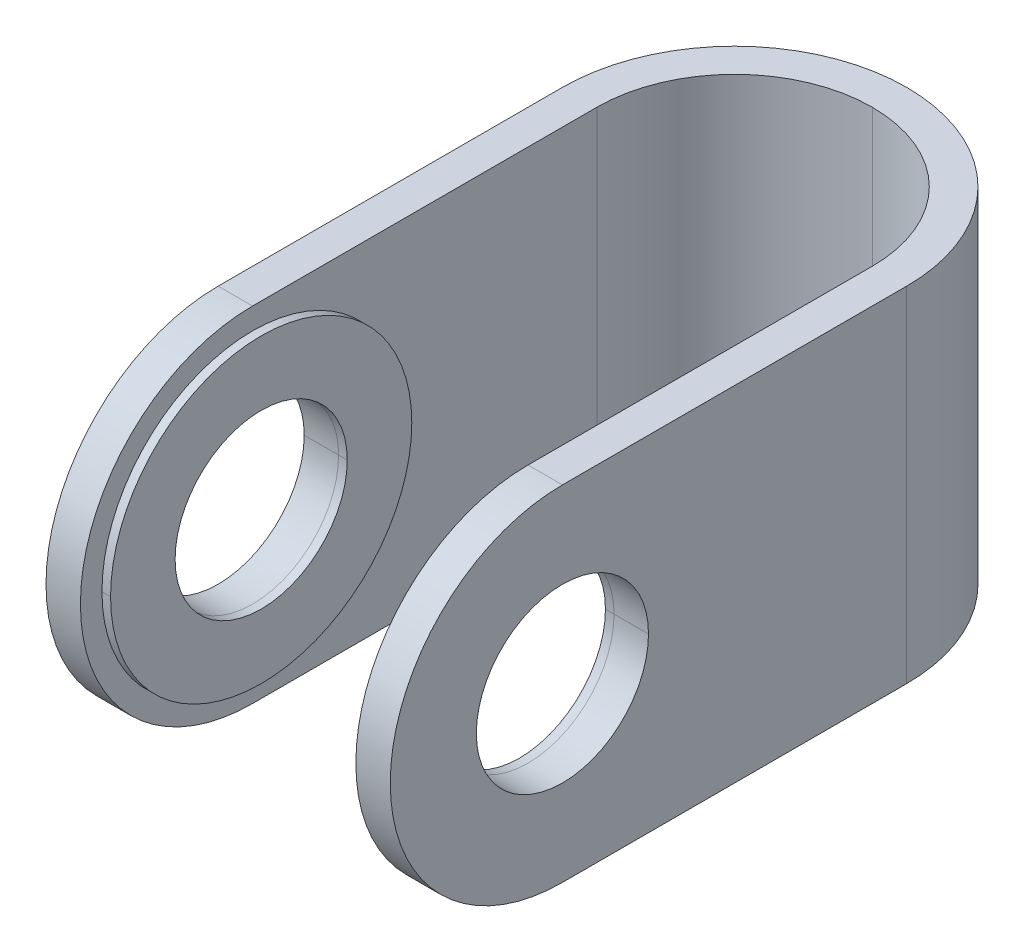
ISO-10303-21;
HEADER;
FILE_DESCRIPTION(('STEP AP214'),'2;1');
FILE_NAME('part.step','',(''),(''),'','','');
FILE_SCHEMA(('AUTOMOTIVE_DESIGN { 1 0 10303 214 1 1 1 1 }'));
ENDSEC;
DATA;
#1=APPLICATION_CONTEXT('core data for automotive mechanical design processes');
#2=APPLICATION_PROTOCOL_DEFINITION('international standard','automotive_design',2000,#1);
#3=PRODUCT_CONTEXT('',#1,'mechanical');
#4=PRODUCT('Part','Part','',(#3));
#5=PRODUCT_RELATED_PRODUCT_CATEGORY('part','',(#4));
#6=PRODUCT_DEFINITION_FORMATION('','',#4);
#7=PRODUCT_DEFINITION_CONTEXT('part definition',#1,'design');
#8=PRODUCT_DEFINITION('design','',#6,#7);
#9=PRODUCT_DEFINITION_SHAPE('','',#8);
#10=(LENGTH_UNIT() NAMED_UNIT(*) SI_UNIT(.MILLI.,.METRE.));
#11=(NAMED_UNIT(*) PLANE_ANGLE_UNIT() SI_UNIT($,.RADIAN.));
#12=(NAMED_UNIT(*) SI_UNIT($,.STERADIAN.) SOLID_ANGLE_UNIT());
#13=UNCERTAINTY_MEASURE_WITH_UNIT(LENGTH_MEASURE(1.E-05),#10,'distance_accuracy_value','');
#14=(GEOMETRIC_REPRESENTATION_CONTEXT(3) GLOBAL_UNCERTAINTY_ASSIGNED_CONTEXT((#13)) GLOBAL_UNIT_ASSIGNED_CONTEXT((#10,
#11,#12)) REPRESENTATION_CONTEXT('',''));
#15=CARTESIAN_POINT('',(0.,0.,0.));
#16=DIRECTION('',(0.,0.,1.));
#17=DIRECTION('',(1.,0.,0.));
#18=AXIS2_PLACEMENT_3D('',#15,#16,#17);
#19=CARTESIAN_POINT('',(17.287097909609,-8.869571953824,-0.784906063037));
#20=DIRECTION('',(1.,0.,0.));
#21=DIRECTION('',(0.,0.,-1.));
#22=AXIS2_PLACEMENT_3D('',#19,#20,#21);
#23=CYLINDRICAL_SURFACE('',#22,2.);
#24=DIRECTION('',(1.,0.,0.));
#25=VECTOR('',#24,1.);
#26=CARTESIAN_POINT('',(17.287097909609,-8.869571953824,1.215093936963));
#27=LINE('',#26,#25);
#28=CARTESIAN_POINT('',(17.287097909609,-8.869571953824,1.215093936963));
#29=VERTEX_POINT('',#28);
#30=CARTESIAN_POINT('',(17.487097909609,-8.869571953824,1.215093936963));
#31=VERTEX_POINT('',#30);
#32=EDGE_CURVE('P0_E98',#29,#31,#27,.T.);
#33=ORIENTED_EDGE('',*,*,#32,.F.);
#34=CARTESIAN_POINT('',(17.287097909609,-8.869571953824,-0.784906063037));
#35=DIRECTION('',(-1.,0.,0.));
#36=DIRECTION('',(0.,0.,1.));
#37=AXIS2_PLACEMENT_3D('',#34,#35,#36);
#38=CIRCLE('',#37,2.);
#39=CARTESIAN_POINT('',(17.287097909609,-8.869571953824,-2.784906063037));
#40=VERTEX_POINT('',#39);
#41=EDGE_CURVE('P0_E61',#29,#40,#38,.T.);
#42=ORIENTED_EDGE('',*,*,#41,.T.);
#43=DIRECTION('',(1.,0.,0.));
#44=VECTOR('',#43,1.);
#45=CARTESIAN_POINT('',(17.287097909609,-8.869571953824,-2.784906063037));
#46=LINE('',#45,#44);
#47=CARTESIAN_POINT('',(17.487097909609,-8.869571953824,-2.784906063037));
#48=VERTEX_POINT('',#47);
#49=EDGE_CURVE('P0_E91',#40,#48,#46,.T.);
#50=ORIENTED_EDGE('',*,*,#49,.T.);
#51=CARTESIAN_POINT('',(17.487097909609,-8.869571953824,-0.784906063037));
#52=DIRECTION('',(-1.,0.,0.));
#53=DIRECTION('',(0.,0.,1.));
#54=AXIS2_PLACEMENT_3D('',#51,#52,#53);
#55=CIRCLE('',#54,2.);
#56=EDGE_CURVE('P0_E11',#31,#48,#55,.T.);
#57=ORIENTED_EDGE('',*,*,#56,.F.);
#58=EDGE_LOOP('',(#33,#42,#50,#57));
#59=FACE_BOUND('',#58,.T.);
#60=ADVANCED_FACE('P0_F17',(#59),#23,.F.);
#61=CARTESIAN_POINT('',(17.287097909609,-8.869571953824,-0.784906063037));
#62=DIRECTION('',(1.,0.,0.));
#63=DIRECTION('',(0.,0.,-1.));
#64=AXIS2_PLACEMENT_3D('',#61,#62,#63);
#65=CYLINDRICAL_SURFACE('',#64,3.5);
#66=DIRECTION('',(1.,0.,0.));
#67=VECTOR('',#66,1.);
#68=CARTESIAN_POINT('',(17.287097909609,-8.869571953824,2.715093936963));
#69=LINE('',#68,#67);
#70=CARTESIAN_POINT('',(17.287097909609,-8.869571953824,2.715093936963));
#71=VERTEX_POINT('',#70);
#72=CARTESIAN_POINT('',(17.487097909609,-8.869571953824,2.715093936963));
#73=VERTEX_POINT('',#72);
#74=EDGE_CURVE('P0_E117',#71,#73,#69,.T.);
#75=ORIENTED_EDGE('',*,*,#74,.F.);
#76=CARTESIAN_POINT('',(17.287097909609,-8.869571953824,-0.784906063037));
#77=DIRECTION('',(-1.,0.,0.));
#78=DIRECTION('',(0.,0.,1.));
#79=AXIS2_PLACEMENT_3D('',#76,#77,#78);
#80=CIRCLE('',#79,3.5);
#81=CARTESIAN_POINT('',(17.287097909609,-8.869571953824,-4.284906063037));
#82=VERTEX_POINT('',#81);
#83=EDGE_CURVE('P0_E82',#82,#71,#80,.T.);
#84=ORIENTED_EDGE('',*,*,#83,.F.);
#85=DIRECTION('',(1.,0.,0.));
#86=VECTOR('',#85,1.);
#87=CARTESIAN_POINT('',(17.287097909609,-8.869571953824,-4.284906063037));
#88=LINE('',#87,#86);
#89=CARTESIAN_POINT('',(17.487097909609,-8.869571953824,-4.284906063037));
#90=VERTEX_POINT('',#89);
#91=EDGE_CURVE('P0_E112',#82,#90,#88,.T.);
#92=ORIENTED_EDGE('',*,*,#91,.T.);
#93=CARTESIAN_POINT('',(17.487097909609,-8.869571953824,-0.784906063037));
#94=DIRECTION('',(-1.,0.,0.));
#95=DIRECTION('',(0.,0.,1.));
#96=AXIS2_PLACEMENT_3D('',#93,#94,#95);
#97=CIRCLE('',#96,3.5);
#98=EDGE_CURVE('P0_E21',#90,#73,#97,.T.);
#99=ORIENTED_EDGE('',*,*,#98,.T.);
#100=EDGE_LOOP('',(#75,#84,#92,#99));
#101=FACE_BOUND('',#100,.T.);
#102=ADVANCED_FACE('P0_F19',(#101),#65,.T.);
#103=CARTESIAN_POINT('',(17.487097909609,-8.869571953824,-0.784906063037));
#104=DIRECTION('',(-1.,0.,0.));
#105=DIRECTION('',(0.,1.,0.));
#106=AXIS2_PLACEMENT_3D('',#103,#104,#105);
#107=PLANE('',#106);
#108=CARTESIAN_POINT('',(17.487097909609,-8.869571953824,-0.784906063037));
#109=DIRECTION('',(-1.,0.,0.));
#110=DIRECTION('',(0.,0.,1.));
#111=AXIS2_PLACEMENT_3D('',#108,#109,#110);
#112=CIRCLE('',#111,2.);
#113=EDGE_CURVE('P0_E89',#48,#31,#112,.T.);
#114=ORIENTED_EDGE('',*,*,#113,.T.);
#115=ORIENTED_EDGE('',*,*,#56,.T.);
#116=EDGE_LOOP('',(#114,#115));
#117=FACE_BOUND('',#116,.T.);
#118=ORIENTED_EDGE('',*,*,#98,.F.);
#119=CARTESIAN_POINT('',(17.487097909609,-8.869571953824,-0.784906063037));
#120=DIRECTION('',(-1.,0.,0.));
#121=DIRECTION('',(0.,0.,1.));
#122=AXIS2_PLACEMENT_3D('',#119,#120,#121);
#123=CIRCLE('',#122,3.5);
#124=EDGE_CURVE('P0_E108',#73,#90,#123,.T.);
#125=ORIENTED_EDGE('',*,*,#124,.F.);
#126=EDGE_LOOP('',(#118,#125));
#127=FACE_BOUND('',#126,.T.);
#128=ADVANCED_FACE('P0_F87',(#117,#127),#107,.F.);
#129=CARTESIAN_POINT('',(17.287097909609,-8.869571953824,-0.784906063037));
#130=DIRECTION('',(-1.,0.,0.));
#131=DIRECTION('',(0.,1.,0.));
#132=AXIS2_PLACEMENT_3D('',#129,#130,#131);
#133=PLANE('',#132);
#134=CARTESIAN_POINT('',(17.287097909609,-8.869571953824,-0.784906063037));
#135=DIRECTION('',(-1.,0.,0.));
#136=DIRECTION('',(0.,0.,1.));
#137=AXIS2_PLACEMENT_3D('',#134,#135,#136);
#138=CIRCLE('',#137,2.);
#139=EDGE_CURVE('P0_E105',#40,#29,#138,.T.);
#140=ORIENTED_EDGE('',*,*,#139,.F.);
#141=ORIENTED_EDGE('',*,*,#41,.F.);
#142=EDGE_LOOP('',(#140,#141));
#143=FACE_BOUND('',#142,.T.);
#144=ORIENTED_EDGE('',*,*,#83,.T.);
#145=CARTESIAN_POINT('',(17.287097909609,-8.869571953824,-0.784906063037));
#146=DIRECTION('',(-1.,0.,0.));
#147=DIRECTION('',(0.,0.,1.));
#148=AXIS2_PLACEMENT_3D('',#145,#146,#147);
#149=CIRCLE('',#148,3.5);
#150=EDGE_CURVE('P0_E95',#71,#82,#149,.T.);
#151=ORIENTED_EDGE('',*,*,#150,.T.);
#152=EDGE_LOOP('',(#144,#151));
#153=FACE_BOUND('',#152,.T.);
#154=ADVANCED_FACE('P0_F138',(#143,#153),#133,.T.);
#155=CARTESIAN_POINT('',(17.287097909609,-8.869571953824,-0.784906063037));
#156=DIRECTION('',(1.,0.,0.));
#157=DIRECTION('',(0.,0.,-1.));
#158=AXIS2_PLACEMENT_3D('',#155,#156,#157);
#159=CYLINDRICAL_SURFACE('',#158,3.5);
#160=ORIENTED_EDGE('',*,*,#150,.F.);
#161=ORIENTED_EDGE('',*,*,#74,.T.);
#162=ORIENTED_EDGE('',*,*,#124,.T.);
#163=ORIENTED_EDGE('',*,*,#91,.F.);
#164=EDGE_LOOP('',(#160,#161,#162,#163));
#165=FACE_BOUND('',#164,.T.);
#166=ADVANCED_FACE('P0_F162',(#165),#159,.T.);
#167=CARTESIAN_POINT('',(17.287097909609,-8.869571953824,-0.784906063037));
#168=DIRECTION('',(1.,0.,0.));
#169=DIRECTION('',(0.,0.,-1.));
#170=AXIS2_PLACEMENT_3D('',#167,#168,#169);
#171=CYLINDRICAL_SURFACE('',#170,2.);
#172=ORIENTED_EDGE('',*,*,#139,.T.);
#173=ORIENTED_EDGE('',*,*,#32,.T.);
#174=ORIENTED_EDGE('',*,*,#113,.F.);
#175=ORIENTED_EDGE('',*,*,#49,.F.);
#176=EDGE_LOOP('',(#172,#173,#174,#175));
#177=FACE_BOUND('',#176,.T.);
#178=ADVANCED_FACE('P0_F97',(#177),#171,.F.);
#179=CLOSED_SHELL('',(#60,#102,#128,#154,#166,#178));
#180=MANIFOLD_SOLID_BREP('P0_B1',#179);
#181=CARTESIAN_POINT('',(23.687097909609,-8.869571953824,-0.784906063037));
#182=DIRECTION('',(-1.,0.,0.));
#183=DIRECTION('',(0.,0.,-1.));
#184=AXIS2_PLACEMENT_3D('',#181,#182,#183);
#185=CYLINDRICAL_SURFACE('',#184,2.);
#186=DIRECTION('',(-1.,0.,0.));
#187=VECTOR('',#186,1.);
#188=CARTESIAN_POINT('',(23.687097909609,-8.869571953824,1.215093936963));
#189=LINE('',#188,#187);
#190=CARTESIAN_POINT('',(23.687097909609,-8.869571953824,1.215093936963));
#191=VERTEX_POINT('',#190);
#192=CARTESIAN_POINT('',(23.487097909609,-8.869571953824,1.215093936963));
#193=VERTEX_POINT('',#192);
#194=EDGE_CURVE('P1_E97',#191,#193,#189,.T.);
#195=ORIENTED_EDGE('',*,*,#194,.F.);
#196=CARTESIAN_POINT('',(23.687097909609,-8.869571953824,-0.784906063037));
#197=DIRECTION('',(1.,0.,0.));
#198=DIRECTION('',(0.,0.,1.));
#199=AXIS2_PLACEMENT_3D('',#196,#197,#198);
#200=CIRCLE('',#199,2.);
#201=CARTESIAN_POINT('',(23.687097909609,-8.869571953824,-2.784906063037));
#202=VERTEX_POINT('',#201);
#203=EDGE_CURVE('P1_E60',#191,#202,#200,.T.);
#204=ORIENTED_EDGE('',*,*,#203,.T.);
#205=DIRECTION('',(-1.,0.,0.));
#206=VECTOR('',#205,1.);
#207=CARTESIAN_POINT('',(23.687097909609,-8.869571953824,-2.784906063037));
#208=LINE('',#207,#206);
#209=CARTESIAN_POINT('',(23.487097909609,-8.869571953824,-2.784906063037));
#210=VERTEX_POINT('',#209);
#211=EDGE_CURVE('P1_E90',#202,#210,#208,.T.);
#212=ORIENTED_EDGE('',*,*,#211,.T.);
#213=CARTESIAN_POINT('',(23.487097909609,-8.869571953824,-0.784906063037));
#214=DIRECTION('',(1.,0.,0.));
#215=DIRECTION('',(0.,0.,1.));
#216=AXIS2_PLACEMENT_3D('',#213,#214,#215);
#217=CIRCLE('',#216,2.);
#218=EDGE_CURVE('P1_E10',#193,#210,#217,.T.);
#219=ORIENTED_EDGE('',*,*,#218,.F.);
#220=EDGE_LOOP('',(#195,#204,#212,#219));
#221=FACE_BOUND('',#220,.T.);
#222=ADVANCED_FACE('P1_F16',(#221),#185,.F.);
#223=CARTESIAN_POINT('',(23.687097909609,-8.869571953824,-0.784906063037));
#224=DIRECTION('',(-1.,0.,0.));
#225=DIRECTION('',(0.,0.,-1.));
#226=AXIS2_PLACEMENT_3D('',#223,#224,#225);
#227=CYLINDRICAL_SURFACE('',#226,3.5);
#228=DIRECTION('',(-1.,0.,0.));
#229=VECTOR('',#228,1.);
#230=CARTESIAN_POINT('',(23.687097909609,-8.869571953824,2.715093936963));
#231=LINE('',#230,#229);
#232=CARTESIAN_POINT('',(23.687097909609,-8.869571953824,2.715093936963));
#233=VERTEX_POINT('',#232);
#234=CARTESIAN_POINT('',(23.487097909609,-8.869571953824,2.715093936963));
#235=VERTEX_POINT('',#234);
#236=EDGE_CURVE('P1_E116',#233,#235,#231,.T.);
#237=ORIENTED_EDGE('',*,*,#236,.F.);
#238=CARTESIAN_POINT('',(23.687097909609,-8.869571953824,-0.784906063037));
#239=DIRECTION('',(1.,0.,0.));
#240=DIRECTION('',(0.,0.,1.));
#241=AXIS2_PLACEMENT_3D('',#238,#239,#240);
#242=CIRCLE('',#241,3.5);
#243=CARTESIAN_POINT('',(23.687097909609,-8.869571953824,-4.284906063037));
#244=VERTEX_POINT('',#243);
#245=EDGE_CURVE('P1_E81',#244,#233,#242,.T.);
#246=ORIENTED_EDGE('',*,*,#245,.F.);
#247=DIRECTION('',(-1.,0.,0.));
#248=VECTOR('',#247,1.);
#249=CARTESIAN_POINT('',(23.687097909609,-8.869571953824,-4.284906063037));
#250=LINE('',#249,#248);
#251=CARTESIAN_POINT('',(23.487097909609,-8.869571953824,-4.284906063037));
#252=VERTEX_POINT('',#251);
#253=EDGE_CURVE('P1_E111',#244,#252,#250,.T.);
#254=ORIENTED_EDGE('',*,*,#253,.T.);
#255=CARTESIAN_POINT('',(23.487097909609,-8.869571953824,-0.784906063037));
#256=DIRECTION('',(1.,0.,0.));
#257=DIRECTION('',(0.,0.,1.));
#258=AXIS2_PLACEMENT_3D('',#255,#256,#257);
#259=CIRCLE('',#258,3.5);
#260=EDGE_CURVE('P1_E20',#252,#235,#259,.T.);
#261=ORIENTED_EDGE('',*,*,#260,.T.);
#262=EDGE_LOOP('',(#237,#246,#254,#261));
#263=FACE_BOUND('',#262,.T.);
#264=ADVANCED_FACE('P1_F18',(#263),#227,.T.);
#265=CARTESIAN_POINT('',(23.487097909609,-8.869571953824,-0.784906063037));
#266=DIRECTION('',(1.,0.,0.));
#267=DIRECTION('',(0.,-1.,0.));
#268=AXIS2_PLACEMENT_3D('',#265,#266,#267);
#269=PLANE('',#268);
#270=CARTESIAN_POINT('',(23.487097909609,-8.869571953824,-0.784906063037));
#271=DIRECTION('',(1.,0.,0.));
#272=DIRECTION('',(0.,0.,1.));
#273=AXIS2_PLACEMENT_3D('',#270,#271,#272);
#274=CIRCLE('',#273,2.);
#275=EDGE_CURVE('P1_E88',#210,#193,#274,.T.);
#276=ORIENTED_EDGE('',*,*,#275,.T.);
#277=ORIENTED_EDGE('',*,*,#218,.T.);
#278=EDGE_LOOP('',(#276,#277));
#279=FACE_BOUND('',#278,.T.);
#280=ORIENTED_EDGE('',*,*,#260,.F.);
#281=CARTESIAN_POINT('',(23.487097909609,-8.869571953824,-0.784906063037));
#282=DIRECTION('',(1.,0.,0.));
#283=DIRECTION('',(0.,0.,1.));
#284=AXIS2_PLACEMENT_3D('',#281,#282,#283);
#285=CIRCLE('',#284,3.5);
#286=EDGE_CURVE('P1_E107',#235,#252,#285,.T.);
#287=ORIENTED_EDGE('',*,*,#286,.F.);
#288=EDGE_LOOP('',(#280,#287));
#289=FACE_BOUND('',#288,.T.);
#290=ADVANCED_FACE('P1_F86',(#279,#289),#269,.F.);
#291=CARTESIAN_POINT('',(23.687097909609,-8.869571953824,-0.784906063037));
#292=DIRECTION('',(1.,0.,0.));
#293=DIRECTION('',(0.,-1.,0.));
#294=AXIS2_PLACEMENT_3D('',#291,#292,#293);
#295=PLANE('',#294);
#296=CARTESIAN_POINT('',(23.687097909609,-8.869571953824,-0.784906063037));
#297=DIRECTION('',(1.,0.,0.));
#298=DIRECTION('',(0.,0.,1.));
#299=AXIS2_PLACEMENT_3D('',#296,#297,#298);
#300=CIRCLE('',#299,2.);
#301=EDGE_CURVE('P1_E104',#202,#191,#300,.T.);
#302=ORIENTED_EDGE('',*,*,#301,.F.);
#303=ORIENTED_EDGE('',*,*,#203,.F.);
#304=EDGE_LOOP('',(#302,#303));
#305=FACE_BOUND('',#304,.T.);
#306=ORIENTED_EDGE('',*,*,#245,.T.);
#307=CARTESIAN_POINT('',(23.687097909609,-8.869571953824,-0.784906063037));
#308=DIRECTION('',(1.,0.,0.));
#309=DIRECTION('',(0.,0.,1.));
#310=AXIS2_PLACEMENT_3D('',#307,#308,#309);
#311=CIRCLE('',#310,3.5);
#312=EDGE_CURVE('P1_E94',#233,#244,#311,.T.);
#313=ORIENTED_EDGE('',*,*,#312,.T.);
#314=EDGE_LOOP('',(#306,#313));
#315=FACE_BOUND('',#314,.T.);
#316=ADVANCED_FACE('P1_F137',(#305,#315),#295,.T.);
#317=CARTESIAN_POINT('',(23.687097909609,-8.869571953824,-0.784906063037));
#318=DIRECTION('',(-1.,0.,0.));
#319=DIRECTION('',(0.,0.,-1.));
#320=AXIS2_PLACEMENT_3D('',#317,#318,#319);
#321=CYLINDRICAL_SURFACE('',#320,3.5);
#322=ORIENTED_EDGE('',*,*,#312,.F.);
#323=ORIENTED_EDGE('',*,*,#236,.T.);
#324=ORIENTED_EDGE('',*,*,#286,.T.);
#325=ORIENTED_EDGE('',*,*,#253,.F.);
#326=EDGE_LOOP('',(#322,#323,#324,#325));
#327=FACE_BOUND('',#326,.T.);
#328=ADVANCED_FACE('P1_F161',(#327),#321,.T.);
#329=CARTESIAN_POINT('',(23.687097909609,-8.869571953824,-0.784906063037));
#330=DIRECTION('',(-1.,0.,0.));
#331=DIRECTION('',(0.,0.,-1.));
#332=AXIS2_PLACEMENT_3D('',#329,#330,#331);
#333=CYLINDRICAL_SURFACE('',#332,2.);
#334=ORIENTED_EDGE('',*,*,#301,.T.);
#335=ORIENTED_EDGE('',*,*,#194,.T.);
#336=ORIENTED_EDGE('',*,*,#275,.F.);
#337=ORIENTED_EDGE('',*,*,#211,.F.);
#338=EDGE_LOOP('',(#334,#335,#336,#337));
#339=FACE_BOUND('',#338,.T.);
#340=ADVANCED_FACE('P1_F96',(#339),#333,.F.);
#341=CLOSED_SHELL('',(#222,#264,#290,#316,#328,#340));
#342=MANIFOLD_SOLID_BREP('P1_B1',#341);
#343=CARTESIAN_POINT('',(16.487097909609,-8.869571953824,-0.784906063036999));
#344=DIRECTION('',(1.,0.,0.));
#345=DIRECTION('',(0.,0.,-1.));
#346=AXIS2_PLACEMENT_3D('',#343,#344,#345);
#347=CYLINDRICAL_SURFACE('',#346,2.);
#348=DIRECTION('',(1.,0.,0.));
#349=VECTOR('',#348,1.);
#350=CARTESIAN_POINT('',(16.487097909609,-8.869571953824,1.215093936963));
#351=LINE('',#350,#349);
#352=CARTESIAN_POINT('',(23.687097909609,-8.869571953824,1.215093936963));
#353=VERTEX_POINT('',#352);
#354=CARTESIAN_POINT('',(24.487097909609,-8.869571953824,1.215093936963));
#355=VERTEX_POINT('',#354);
#356=EDGE_CURVE('P2_E246',#353,#355,#351,.T.);
#357=ORIENTED_EDGE('',*,*,#356,.F.);
#358=CARTESIAN_POINT('',(23.687097909609,-8.869571953824,-0.784906063036999));
#359=DIRECTION('',(1.,0.,0.));
#360=DIRECTION('',(0.,0.,-1.));
#361=AXIS2_PLACEMENT_3D('',#358,#359,#360);
#362=CIRCLE('',#361,2.);
#363=CARTESIAN_POINT('',(23.687097909609,-8.869571953824,-2.784906063037));
#364=VERTEX_POINT('',#363);
#365=EDGE_CURVE('P2_E192',#364,#353,#362,.T.);
#366=ORIENTED_EDGE('',*,*,#365,.F.);
#367=DIRECTION('',(1.,0.,0.));
#368=VECTOR('',#367,1.);
#369=CARTESIAN_POINT('',(16.487097909609,-8.869571953824,-2.784906063037));
#370=LINE('',#369,#368);
#371=CARTESIAN_POINT('',(24.487097909609,-8.869571953824,-2.784906063037));
#372=VERTEX_POINT('',#371);
#373=EDGE_CURVE('P2_E256',#364,#372,#370,.T.);
#374=ORIENTED_EDGE('',*,*,#373,.T.);
#375=CARTESIAN_POINT('',(24.487097909609,-8.869571953824,-0.784906063036999));
#376=DIRECTION('',(1.,0.,0.));
#377=DIRECTION('',(0.,0.,-1.));
#378=AXIS2_PLACEMENT_3D('',#375,#376,#377);
#379=CIRCLE('',#378,2.);
#380=EDGE_CURVE('P2_E299',#372,#355,#379,.T.);
#381=ORIENTED_EDGE('',*,*,#380,.T.);
#382=EDGE_LOOP('',(#357,#366,#374,#381));
#383=FACE_BOUND('',#382,.T.);
#384=ADVANCED_FACE('P2_F17',(#383),#347,.F.);
#385=CARTESIAN_POINT('',(16.487097909609,-8.869571953824,-0.784906063036999));
#386=DIRECTION('',(1.,0.,0.));
#387=DIRECTION('',(0.,0.,-1.));
#388=AXIS2_PLACEMENT_3D('',#385,#386,#387);
#389=CYLINDRICAL_SURFACE('',#388,2.);
#390=DIRECTION('',(1.,0.,0.));
#391=VECTOR('',#390,1.);
#392=CARTESIAN_POINT('',(16.487097909609,-8.869571953824,1.215093936963));
#393=LINE('',#392,#391);
#394=CARTESIAN_POINT('',(16.487097909609,-8.869571953824,1.215093936963));
#395=VERTEX_POINT('',#394);
#396=CARTESIAN_POINT('',(17.287097909609,-8.869571953824,1.215093936963));
#397=VERTEX_POINT('',#396);
#398=EDGE_CURVE('P2_E211',#395,#397,#393,.T.);
#399=ORIENTED_EDGE('',*,*,#398,.F.);
#400=CARTESIAN_POINT('',(16.487097909609,-8.869571953824,-0.784906063036999));
#401=DIRECTION('',(1.,0.,0.));
#402=DIRECTION('',(0.,0.,-1.));
#403=AXIS2_PLACEMENT_3D('',#400,#401,#402);
#404=CIRCLE('',#403,2.);
#405=CARTESIAN_POINT('',(16.487097909609,-8.869571953824,-2.784906063037));
#406=VERTEX_POINT('',#405);
#407=EDGE_CURVE('P2_E108',#406,#395,#404,.T.);
#408=ORIENTED_EDGE('',*,*,#407,.F.);
#409=DIRECTION('',(1.,0.,0.));
#410=VECTOR('',#409,1.);
#411=CARTESIAN_POINT('',(16.487097909609,-8.869571953824,-2.784906063037));
#412=LINE('',#411,#410);
#413=CARTESIAN_POINT('',(17.287097909609,-8.869571953824,-2.784906063037));
#414=VERTEX_POINT('',#413);
#415=EDGE_CURVE('P2_E229',#406,#414,#412,.T.);
#416=ORIENTED_EDGE('',*,*,#415,.T.);
#417=CARTESIAN_POINT('',(17.287097909609,-8.869571953824,-0.784906063036999));
#418=DIRECTION('',(1.,0.,0.));
#419=DIRECTION('',(0.,0.,-1.));
#420=AXIS2_PLACEMENT_3D('',#417,#418,#419);
#421=CIRCLE('',#420,2.);
#422=EDGE_CURVE('P2_E92',#414,#397,#421,.T.);
#423=ORIENTED_EDGE('',*,*,#422,.T.);
#424=EDGE_LOOP('',(#399,#408,#416,#423));
#425=FACE_BOUND('',#424,.T.);
#426=ADVANCED_FACE('P2_F377',(#425),#389,.F.);
#427=CARTESIAN_POINT('',(16.487097909609,-8.869571953824,-0.784906063036999));
#428=DIRECTION('',(1.,0.,0.));
#429=DIRECTION('',(0.,0.,-1.));
#430=AXIS2_PLACEMENT_3D('',#427,#428,#429);
#431=CYLINDRICAL_SURFACE('',#430,4.);
#432=DIRECTION('',(1.,0.,0.));
#433=VECTOR('',#432,1.);
#434=CARTESIAN_POINT('',(16.487097909609,-4.869571953824,-0.784906063036999));
#435=LINE('',#434,#433);
#436=CARTESIAN_POINT('',(16.487097909609,-4.869571953824,-0.784906063036999));
#437=VERTEX_POINT('',#436);
#438=CARTESIAN_POINT('',(17.287097909609,-4.869571953824,-0.784906063036999));
#439=VERTEX_POINT('',#438);
#440=EDGE_CURVE('P2_E43',#437,#439,#435,.T.);
#441=ORIENTED_EDGE('',*,*,#440,.F.);
#442=CARTESIAN_POINT('',(16.487097909609,-8.869571953824,-0.784906063036999));
#443=DIRECTION('',(1.,0.,0.));
#444=DIRECTION('',(0.,0.,-1.));
#445=AXIS2_PLACEMENT_3D('',#442,#443,#444);
#446=CIRCLE('',#445,4.);
#447=CARTESIAN_POINT('',(16.487097909609,-12.869571953824,-0.784906063036999));
#448=VERTEX_POINT('',#447);
#449=EDGE_CURVE('P2_E205',#437,#448,#446,.T.);
#450=ORIENTED_EDGE('',*,*,#449,.T.);
#451=DIRECTION('',(1.,0.,0.));
#452=VECTOR('',#451,1.);
#453=CARTESIAN_POINT('',(16.487097909609,-12.869571953824,-0.784906063036999));
#454=LINE('',#453,#452);
#455=CARTESIAN_POINT('',(17.287097909609,-12.869571953824,-0.784906063036999));
#456=VERTEX_POINT('',#455);
#457=EDGE_CURVE('P2_E171',#448,#456,#454,.T.);
#458=ORIENTED_EDGE('',*,*,#457,.T.);
#459=CARTESIAN_POINT('',(17.287097909609,-8.869571953824,-0.784906063036999));
#460=DIRECTION('',(1.,0.,0.));
#461=DIRECTION('',(0.,0.,-1.));
#462=AXIS2_PLACEMENT_3D('',#459,#460,#461);
#463=CIRCLE('',#462,4.);
#464=EDGE_CURVE('P2_E201',#439,#456,#463,.T.);
#465=ORIENTED_EDGE('',*,*,#464,.F.);
#466=EDGE_LOOP('',(#441,#450,#458,#465));
#467=FACE_BOUND('',#466,.T.);
#468=ADVANCED_FACE('P2_F372',(#467),#431,.T.);
#469=CARTESIAN_POINT('',(16.487097909609,-8.869571953824,-0.784906063036999));
#470=DIRECTION('',(1.,0.,0.));
#471=DIRECTION('',(0.,0.,-1.));
#472=AXIS2_PLACEMENT_3D('',#469,#470,#471);
#473=CYLINDRICAL_SURFACE('',#472,4.);
#474=CARTESIAN_POINT('',(23.687097909609,-8.869571953824,-0.784906063036999));
#475=DIRECTION('',(1.,0.,0.));
#476=DIRECTION('',(0.,0.,-1.));
#477=AXIS2_PLACEMENT_3D('',#474,#475,#476);
#478=CIRCLE('',#477,4.);
#479=CARTESIAN_POINT('',(23.687097909609,-4.869571953824,-0.784906063036999));
#480=VERTEX_POINT('',#479);
#481=CARTESIAN_POINT('',(23.687097909609,-12.869571953824,-0.784906063036999));
#482=VERTEX_POINT('',#481);
#483=EDGE_CURVE('P2_E253',#480,#482,#478,.T.);
#484=ORIENTED_EDGE('',*,*,#483,.T.);
#485=DIRECTION('',(1.,0.,0.));
#486=VECTOR('',#485,1.);
#487=CARTESIAN_POINT('',(16.487097909609,-12.869571953824,-0.784906063036999));
#488=LINE('',#487,#486);
#489=CARTESIAN_POINT('',(24.487097909609,-12.869571953824,-0.784906063036999));
#490=VERTEX_POINT('',#489);
#491=EDGE_CURVE('P2_E170',#482,#490,#488,.T.);
#492=ORIENTED_EDGE('',*,*,#491,.T.);
#493=CARTESIAN_POINT('',(24.487097909609,-8.869571953824,-0.784906063036999));
#494=DIRECTION('',(1.,0.,0.));
#495=DIRECTION('',(0.,0.,-1.));
#496=AXIS2_PLACEMENT_3D('',#493,#494,#495);
#497=CIRCLE('',#496,4.);
#498=CARTESIAN_POINT('',(24.487097909609,-4.869571953824,-0.784906063036999));
#499=VERTEX_POINT('',#498);
#500=EDGE_CURVE('P2_E184',#499,#490,#497,.T.);
#501=ORIENTED_EDGE('',*,*,#500,.F.);
#502=DIRECTION('',(1.,0.,0.));
#503=VECTOR('',#502,1.);
#504=CARTESIAN_POINT('',(16.487097909609,-4.869571953824,-0.784906063036999));
#505=LINE('',#504,#503);
#506=EDGE_CURVE('P2_E28',#480,#499,#505,.T.);
#507=ORIENTED_EDGE('',*,*,#506,.F.);
#508=EDGE_LOOP('',(#484,#492,#501,#507));
#509=FACE_BOUND('',#508,.T.);
#510=ADVANCED_FACE('P2_F336',(#509),#473,.T.);
#511=CARTESIAN_POINT('',(20.487097909609,-4.869571953824,-8.784906063037));
#512=DIRECTION('',(0.,-1.,0.));
#513=DIRECTION('',(0.,0.,-1.));
#514=AXIS2_PLACEMENT_3D('',#511,#512,#513);
#515=CYLINDRICAL_SURFACE('',#514,4.);
#516=DIRECTION('',(0.,-1.,0.));
#517=VECTOR('',#516,1.);
#518=CARTESIAN_POINT('',(20.487097909609,-4.869571953824,-12.784906063037));
#519=LINE('',#518,#517);
#520=CARTESIAN_POINT('',(20.487097909609,-4.869571953824,-12.784906063037));
#521=VERTEX_POINT('',#520);
#522=CARTESIAN_POINT('',(20.487097909609,-12.869571953824,-12.784906063037));
#523=VERTEX_POINT('',#522);
#524=EDGE_CURVE('P2_E228',#521,#523,#519,.T.);
#525=ORIENTED_EDGE('',*,*,#524,.F.);
#526=CARTESIAN_POINT('',(20.487097909609,-4.869571953824,-8.784906063037));
#527=DIRECTION('',(0.,1.,0.));
#528=DIRECTION('',(0.,0.,1.));
#529=AXIS2_PLACEMENT_3D('',#526,#527,#528);
#530=CIRCLE('',#529,4.);
#531=CARTESIAN_POINT('',(24.487097909609,-4.869571953824,-8.784906063037));
#532=VERTEX_POINT('',#531);
#533=EDGE_CURVE('P2_E11',#532,#521,#530,.T.);
#534=ORIENTED_EDGE('',*,*,#533,.F.);
#535=DIRECTION('',(0.,-1.,0.));
#536=VECTOR('',#535,1.);
#537=CARTESIAN_POINT('',(24.487097909609,-4.869571953824,-8.784906063037));
#538=LINE('',#537,#536);
#539=CARTESIAN_POINT('',(24.487097909609,-12.869571953824,-8.784906063037));
#540=VERTEX_POINT('',#539);
#541=EDGE_CURVE('P2_E174',#532,#540,#538,.T.);
#542=ORIENTED_EDGE('',*,*,#541,.T.);
#543=CARTESIAN_POINT('',(20.487097909609,-12.869571953824,-8.784906063037));
#544=DIRECTION('',(0.,1.,0.));
#545=DIRECTION('',(0.,0.,1.));
#546=AXIS2_PLACEMENT_3D('',#543,#544,#545);
#547=CIRCLE('',#546,4.);
#548=EDGE_CURVE('P2_E158',#540,#523,#547,.T.);
#549=ORIENTED_EDGE('',*,*,#548,.T.);
#550=EDGE_LOOP('',(#525,#534,#542,#549));
#551=FACE_BOUND('',#550,.T.);
#552=ADVANCED_FACE('P2_F175',(#551),#515,.T.);
#553=CARTESIAN_POINT('',(20.487097909609,-4.869571953824,-8.784906063037));
#554=DIRECTION('',(0.,-1.,0.));
#555=DIRECTION('',(0.,0.,-1.));
#556=AXIS2_PLACEMENT_3D('',#553,#554,#555);
#557=CYLINDRICAL_SURFACE('',#556,3.2);
#558=DIRECTION('',(0.,-1.,0.));
#559=VECTOR('',#558,1.);
#560=CARTESIAN_POINT('',(20.487097909609,-4.869571953824,-11.984906063037));
#561=LINE('',#560,#559);
#562=CARTESIAN_POINT('',(20.487097909609,-4.869571953824,-11.984906063037));
#563=VERTEX_POINT('',#562);
#564=CARTESIAN_POINT('',(20.487097909609,-12.869571953824,-11.984906063037));
#565=VERTEX_POINT('',#564);
#566=EDGE_CURVE('P2_E232',#563,#565,#561,.T.);
#567=ORIENTED_EDGE('',*,*,#566,.F.);
#568=CARTESIAN_POINT('',(20.487097909609,-4.869571953824,-8.784906063037));
#569=DIRECTION('',(0.,1.,0.));
#570=DIRECTION('',(0.,0.,1.));
#571=AXIS2_PLACEMENT_3D('',#568,#569,#570);
#572=CIRCLE('',#571,3.2);
#573=CARTESIAN_POINT('',(17.287097909609,-4.869571953824,-8.784906063037));
#574=VERTEX_POINT('',#573);
#575=EDGE_CURVE('P2_E239',#563,#574,#572,.T.);
#576=ORIENTED_EDGE('',*,*,#575,.T.);
#577=DIRECTION('',(0.,-1.,0.));
#578=VECTOR('',#577,1.);
#579=CARTESIAN_POINT('',(17.287097909609,-4.869571953824,-8.784906063037));
#580=LINE('',#579,#578);
#581=CARTESIAN_POINT('',(17.287097909609,-12.869571953824,-8.784906063037));
#582=VERTEX_POINT('',#581);
#583=EDGE_CURVE('P2_E271',#574,#582,#580,.T.);
#584=ORIENTED_EDGE('',*,*,#583,.T.);
#585=CARTESIAN_POINT('',(20.487097909609,-12.869571953824,-8.784906063037));
#586=DIRECTION('',(0.,1.,0.));
#587=DIRECTION('',(0.,0.,1.));
#588=AXIS2_PLACEMENT_3D('',#585,#586,#587);
#589=CIRCLE('',#588,3.2);
#590=EDGE_CURVE('P2_E223',#565,#582,#589,.T.);
#591=ORIENTED_EDGE('',*,*,#590,.F.);
#592=EDGE_LOOP('',(#567,#576,#584,#591));
#593=FACE_BOUND('',#592,.T.);
#594=ADVANCED_FACE('P2_F311',(#593),#557,.F.);
#595=CARTESIAN_POINT('',(20.487097909609,-4.869571953824,-8.784906063037));
#596=DIRECTION('',(0.,1.,0.));
#597=DIRECTION('',(1.,0.,0.));
#598=AXIS2_PLACEMENT_3D('',#595,#596,#597);
#599=PLANE('',#598);
#600=DIRECTION('',(0.,0.,-1.));
#601=VECTOR('',#600,1.);
#602=CARTESIAN_POINT('',(16.487097909609,-4.869571953824,-8.784906063037));
#603=LINE('',#602,#601);
#604=CARTESIAN_POINT('',(16.487097909609,-4.869571953824,-8.784906063037));
#605=VERTEX_POINT('',#604);
#606=EDGE_CURVE('P2_E202',#437,#605,#603,.T.);
#607=ORIENTED_EDGE('',*,*,#606,.F.);
#608=ORIENTED_EDGE('',*,*,#440,.T.);
#609=DIRECTION('',(0.,0.,1.));
#610=VECTOR('',#609,1.);
#611=CARTESIAN_POINT('',(17.287097909609,-4.869571953824,-8.784906063037));
#612=LINE('',#611,#610);
#613=EDGE_CURVE('P2_E21',#574,#439,#612,.T.);
#614=ORIENTED_EDGE('',*,*,#613,.F.);
#615=ORIENTED_EDGE('',*,*,#575,.F.);
#616=CARTESIAN_POINT('',(20.487097909609,-4.869571953824,-8.784906063037));
#617=DIRECTION('',(0.,1.,0.));
#618=DIRECTION('',(0.,0.,1.));
#619=AXIS2_PLACEMENT_3D('',#616,#617,#618);
#620=CIRCLE('',#619,3.2);
#621=CARTESIAN_POINT('',(23.687097909609,-4.869571953824,-8.784906063037));
#622=VERTEX_POINT('',#621);
#623=EDGE_CURVE('P2_E210',#622,#563,#620,.T.);
#624=ORIENTED_EDGE('',*,*,#623,.F.);
#625=DIRECTION('',(0.,0.,1.));
#626=VECTOR('',#625,1.);
#627=CARTESIAN_POINT('',(23.687097909609,-4.869571953824,-8.784906063037));
#628=LINE('',#627,#626);
#629=EDGE_CURVE('P2_E249',#622,#480,#628,.T.);
#630=ORIENTED_EDGE('',*,*,#629,.T.);
#631=ORIENTED_EDGE('',*,*,#506,.T.);
#632=DIRECTION('',(0.,0.,-1.));
#633=VECTOR('',#632,1.);
#634=CARTESIAN_POINT('',(24.487097909609,-4.869571953824,-8.784906063037));
#635=LINE('',#634,#633);
#636=EDGE_CURVE('P2_E180',#499,#532,#635,.T.);
#637=ORIENTED_EDGE('',*,*,#636,.T.);
#638=ORIENTED_EDGE('',*,*,#533,.T.);
#639=CARTESIAN_POINT('',(20.487097909609,-4.869571953824,-8.784906063037));
#640=DIRECTION('',(0.,1.,0.));
#641=DIRECTION('',(0.,0.,1.));
#642=AXIS2_PLACEMENT_3D('',#639,#640,#641);
#643=CIRCLE('',#642,4.);
#644=EDGE_CURVE('P2_E224',#521,#605,#643,.T.);
#645=ORIENTED_EDGE('',*,*,#644,.T.);
#646=EDGE_LOOP('',(#607,#608,#614,#615,#624,#630,#631,#637,#638,#645));
#647=FACE_BOUND('',#646,.T.);
#648=ADVANCED_FACE('P2_F318',(#647),#599,.T.);
#649=CARTESIAN_POINT('',(20.487097909609,-12.869571953824,-8.784906063037));
#650=DIRECTION('',(0.,1.,0.));
#651=DIRECTION('',(1.,0.,0.));
#652=AXIS2_PLACEMENT_3D('',#649,#650,#651);
#653=PLANE('',#652);
#654=ORIENTED_EDGE('',*,*,#457,.F.);
#655=DIRECTION('',(0.,0.,-1.));
#656=VECTOR('',#655,1.);
#657=CARTESIAN_POINT('',(16.487097909609,-12.869571953824,-8.784906063037));
#658=LINE('',#657,#656);
#659=CARTESIAN_POINT('',(16.487097909609,-12.869571953824,-8.784906063037));
#660=VERTEX_POINT('',#659);
#661=EDGE_CURVE('P2_E282',#448,#660,#658,.T.);
#662=ORIENTED_EDGE('',*,*,#661,.T.);
#663=CARTESIAN_POINT('',(20.487097909609,-12.869571953824,-8.784906063037));
#664=DIRECTION('',(0.,1.,0.));
#665=DIRECTION('',(0.,0.,1.));
#666=AXIS2_PLACEMENT_3D('',#663,#664,#665);
#667=CIRCLE('',#666,4.);
#668=EDGE_CURVE('P2_E165',#523,#660,#667,.T.);
#669=ORIENTED_EDGE('',*,*,#668,.F.);
#670=ORIENTED_EDGE('',*,*,#548,.F.);
#671=DIRECTION('',(0.,0.,-1.));
#672=VECTOR('',#671,1.);
#673=CARTESIAN_POINT('',(24.487097909609,-12.869571953824,-8.784906063037));
#674=LINE('',#673,#672);
#675=EDGE_CURVE('P2_E162',#490,#540,#674,.T.);
#676=ORIENTED_EDGE('',*,*,#675,.F.);
#677=ORIENTED_EDGE('',*,*,#491,.F.);
#678=DIRECTION('',(0.,0.,1.));
#679=VECTOR('',#678,1.);
#680=CARTESIAN_POINT('',(23.687097909609,-12.869571953824,-8.784906063037));
#681=LINE('',#680,#679);
#682=CARTESIAN_POINT('',(23.687097909609,-12.869571953824,-8.784906063037));
#683=VERTEX_POINT('',#682);
#684=EDGE_CURVE('P2_E261',#683,#482,#681,.T.);
#685=ORIENTED_EDGE('',*,*,#684,.F.);
#686=CARTESIAN_POINT('',(20.487097909609,-12.869571953824,-8.784906063037));
#687=DIRECTION('',(0.,1.,0.));
#688=DIRECTION('',(0.,0.,1.));
#689=AXIS2_PLACEMENT_3D('',#686,#687,#688);
#690=CIRCLE('',#689,3.2);
#691=EDGE_CURVE('P2_E196',#683,#565,#690,.T.);
#692=ORIENTED_EDGE('',*,*,#691,.T.);
#693=ORIENTED_EDGE('',*,*,#590,.T.);
#694=DIRECTION('',(0.,0.,1.));
#695=VECTOR('',#694,1.);
#696=CARTESIAN_POINT('',(17.287097909609,-12.869571953824,-8.784906063037));
#697=LINE('',#696,#695);
#698=EDGE_CURVE('P2_E267',#582,#456,#697,.T.);
#699=ORIENTED_EDGE('',*,*,#698,.T.);
#700=EDGE_LOOP('',(#654,#662,#669,#670,#676,#677,#685,#692,#693,#699));
#701=FACE_BOUND('',#700,.T.);
#702=ADVANCED_FACE('P2_F160',(#701),#653,.F.);
#703=CARTESIAN_POINT('',(16.487097909609,-4.869571953824,-8.784906063037));
#704=DIRECTION('',(-1.,0.,0.));
#705=DIRECTION('',(0.,0.,1.));
#706=AXIS2_PLACEMENT_3D('',#703,#704,#705);
#707=PLANE('',#706);
#708=ORIENTED_EDGE('',*,*,#407,.T.);
#709=CARTESIAN_POINT('',(16.487097909609,-8.869571953824,-0.784906063036999));
#710=DIRECTION('',(1.,0.,0.));
#711=DIRECTION('',(0.,0.,-1.));
#712=AXIS2_PLACEMENT_3D('',#709,#710,#711);
#713=CIRCLE('',#712,2.);
#714=EDGE_CURVE('P2_E216',#395,#406,#713,.T.);
#715=ORIENTED_EDGE('',*,*,#714,.T.);
#716=EDGE_LOOP('',(#708,#715));
#717=FACE_BOUND('',#716,.T.);
#718=ORIENTED_EDGE('',*,*,#661,.F.);
#719=ORIENTED_EDGE('',*,*,#449,.F.);
#720=ORIENTED_EDGE('',*,*,#606,.T.);
#721=DIRECTION('',(0.,-1.,0.));
#722=VECTOR('',#721,1.);
#723=CARTESIAN_POINT('',(16.487097909609,-4.869571953824,-8.784906063037));
#724=LINE('',#723,#722);
#725=EDGE_CURVE('P2_E206',#605,#660,#724,.T.);
#726=ORIENTED_EDGE('',*,*,#725,.T.);
#727=EDGE_LOOP('',(#718,#719,#720,#726));
#728=FACE_BOUND('',#727,.T.);
#729=ADVANCED_FACE('P2_F432',(#717,#728),#707,.T.);
#730=CARTESIAN_POINT('',(24.487097909609,-4.869571953824,-8.784906063037));
#731=DIRECTION('',(-1.,0.,0.));
#732=DIRECTION('',(0.,0.,1.));
#733=AXIS2_PLACEMENT_3D('',#730,#731,#732);
#734=PLANE('',#733);
#735=ORIENTED_EDGE('',*,*,#380,.F.);
#736=CARTESIAN_POINT('',(24.487097909609,-8.869571953824,-0.784906063036999));
#737=DIRECTION('',(1.,0.,0.));
#738=DIRECTION('',(0.,0.,-1.));
#739=AXIS2_PLACEMENT_3D('',#736,#737,#738);
#740=CIRCLE('',#739,2.);
#741=EDGE_CURVE('P2_E259',#355,#372,#740,.T.);
#742=ORIENTED_EDGE('',*,*,#741,.F.);
#743=EDGE_LOOP('',(#735,#742));
#744=FACE_BOUND('',#743,.T.);
#745=ORIENTED_EDGE('',*,*,#500,.T.);
#746=ORIENTED_EDGE('',*,*,#675,.T.);
#747=ORIENTED_EDGE('',*,*,#541,.F.);
#748=ORIENTED_EDGE('',*,*,#636,.F.);
#749=EDGE_LOOP('',(#745,#746,#747,#748));
#750=FACE_BOUND('',#749,.T.);
#751=ADVANCED_FACE('P2_F182',(#744,#750),#734,.F.);
#752=CARTESIAN_POINT('',(23.687097909609,-4.869571953824,-8.784906063037));
#753=DIRECTION('',(1.,0.,0.));
#754=DIRECTION('',(0.,0.,1.));
#755=AXIS2_PLACEMENT_3D('',#752,#753,#754);
#756=PLANE('',#755);
#757=ORIENTED_EDGE('',*,*,#365,.T.);
#758=CARTESIAN_POINT('',(23.687097909609,-8.869571953824,-0.784906063036999));
#759=DIRECTION('',(1.,0.,0.));
#760=DIRECTION('',(0.,0.,-1.));
#761=AXIS2_PLACEMENT_3D('',#758,#759,#760);
#762=CIRCLE('',#761,2.);
#763=EDGE_CURVE('P2_E242',#353,#364,#762,.T.);
#764=ORIENTED_EDGE('',*,*,#763,.T.);
#765=EDGE_LOOP('',(#757,#764));
#766=FACE_BOUND('',#765,.T.);
#767=ORIENTED_EDGE('',*,*,#684,.T.);
#768=ORIENTED_EDGE('',*,*,#483,.F.);
#769=ORIENTED_EDGE('',*,*,#629,.F.);
#770=DIRECTION('',(0.,-1.,0.));
#771=VECTOR('',#770,1.);
#772=CARTESIAN_POINT('',(23.687097909609,-4.869571953824,-8.784906063037));
#773=LINE('',#772,#771);
#774=EDGE_CURVE('P2_E198',#622,#683,#773,.T.);
#775=ORIENTED_EDGE('',*,*,#774,.T.);
#776=EDGE_LOOP('',(#767,#768,#769,#775));
#777=FACE_BOUND('',#776,.T.);
#778=ADVANCED_FACE('P2_F19',(#766,#777),#756,.F.);
#779=CARTESIAN_POINT('',(17.287097909609,-4.869571953824,-8.784906063037));
#780=DIRECTION('',(1.,0.,0.));
#781=DIRECTION('',(0.,0.,-1.));
#782=AXIS2_PLACEMENT_3D('',#779,#780,#781);
#783=PLANE('',#782);
#784=ORIENTED_EDGE('',*,*,#422,.F.);
#785=CARTESIAN_POINT('',(17.287097909609,-8.869571953824,-0.784906063036999));
#786=DIRECTION('',(1.,0.,0.));
#787=DIRECTION('',(0.,0.,-1.));
#788=AXIS2_PLACEMENT_3D('',#785,#786,#787);
#789=CIRCLE('',#788,2.);
#790=EDGE_CURVE('P2_E215',#397,#414,#789,.T.);
#791=ORIENTED_EDGE('',*,*,#790,.F.);
#792=EDGE_LOOP('',(#784,#791));
#793=FACE_BOUND('',#792,.T.);
#794=ORIENTED_EDGE('',*,*,#464,.T.);
#795=ORIENTED_EDGE('',*,*,#698,.F.);
#796=ORIENTED_EDGE('',*,*,#583,.F.);
#797=ORIENTED_EDGE('',*,*,#613,.T.);
#798=EDGE_LOOP('',(#794,#795,#796,#797));
#799=FACE_BOUND('',#798,.T.);
#800=ADVANCED_FACE('P2_F320',(#793,#799),#783,.T.);
#801=CARTESIAN_POINT('',(20.487097909609,-4.869571953824,-8.784906063037));
#802=DIRECTION('',(0.,-1.,0.));
#803=DIRECTION('',(0.,0.,-1.));
#804=AXIS2_PLACEMENT_3D('',#801,#802,#803);
#805=CYLINDRICAL_SURFACE('',#804,3.2);
#806=ORIENTED_EDGE('',*,*,#623,.T.);
#807=ORIENTED_EDGE('',*,*,#566,.T.);
#808=ORIENTED_EDGE('',*,*,#691,.F.);
#809=ORIENTED_EDGE('',*,*,#774,.F.);
#810=EDGE_LOOP('',(#806,#807,#808,#809));
#811=FACE_BOUND('',#810,.T.);
#812=ADVANCED_FACE('P2_F330',(#811),#805,.F.);
#813=CARTESIAN_POINT('',(20.487097909609,-4.869571953824,-8.784906063037));
#814=DIRECTION('',(0.,-1.,0.));
#815=DIRECTION('',(0.,0.,-1.));
#816=AXIS2_PLACEMENT_3D('',#813,#814,#815);
#817=CYLINDRICAL_SURFACE('',#816,4.);
#818=ORIENTED_EDGE('',*,*,#644,.F.);
#819=ORIENTED_EDGE('',*,*,#524,.T.);
#820=ORIENTED_EDGE('',*,*,#668,.T.);
#821=ORIENTED_EDGE('',*,*,#725,.F.);
#822=EDGE_LOOP('',(#818,#819,#820,#821));
#823=FACE_BOUND('',#822,.T.);
#824=ADVANCED_FACE('P2_F420',(#823),#817,.T.);
#825=CARTESIAN_POINT('',(16.487097909609,-8.869571953824,-0.784906063036999));
#826=DIRECTION('',(1.,0.,0.));
#827=DIRECTION('',(0.,0.,-1.));
#828=AXIS2_PLACEMENT_3D('',#825,#826,#827);
#829=CYLINDRICAL_SURFACE('',#828,2.);
#830=ORIENTED_EDGE('',*,*,#714,.F.);
#831=ORIENTED_EDGE('',*,*,#398,.T.);
#832=ORIENTED_EDGE('',*,*,#790,.T.);
#833=ORIENTED_EDGE('',*,*,#415,.F.);
#834=EDGE_LOOP('',(#830,#831,#832,#833));
#835=FACE_BOUND('',#834,.T.);
#836=ADVANCED_FACE('P2_F445',(#835),#829,.F.);
#837=CARTESIAN_POINT('',(16.487097909609,-8.869571953824,-0.784906063036999));
#838=DIRECTION('',(1.,0.,0.));
#839=DIRECTION('',(0.,0.,-1.));
#840=AXIS2_PLACEMENT_3D('',#837,#838,#839);
#841=CYLINDRICAL_SURFACE('',#840,2.);
#842=ORIENTED_EDGE('',*,*,#763,.F.);
#843=ORIENTED_EDGE('',*,*,#356,.T.);
#844=ORIENTED_EDGE('',*,*,#741,.T.);
#845=ORIENTED_EDGE('',*,*,#373,.F.);
#846=EDGE_LOOP('',(#842,#843,#844,#845));
#847=FACE_BOUND('',#846,.T.);
#848=ADVANCED_FACE('P2_F440',(#847),#841,.F.);
#849=CLOSED_SHELL('',(#384,#426,#468,#510,#552,#594,#648,#702,#729,#751,#778,#800,#812,#824,
#836,#848));
#850=MANIFOLD_SOLID_BREP('P2_B1',#849);
#851=ADVANCED_BREP_SHAPE_REPRESENTATION('',(#18,#180,#342,#850),#14);
#852=SHAPE_DEFINITION_REPRESENTATION(#9,#851);
ENDSEC;
END-ISO-10303-21;
